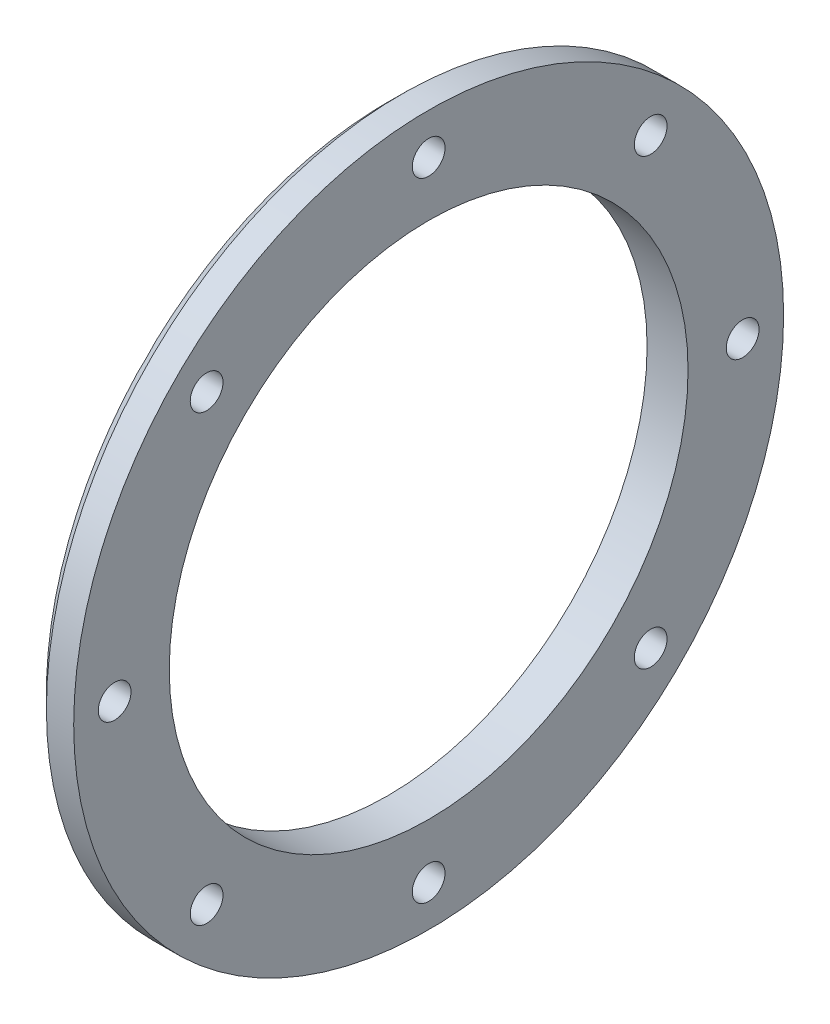
ISO-10303-21;
HEADER;
FILE_DESCRIPTION(('STEP AP214'),'2;1');
FILE_NAME('part.step','',(''),(''),'','','');
FILE_SCHEMA(('AUTOMOTIVE_DESIGN { 1 0 10303 214 1 1 1 1 }'));
ENDSEC;
DATA;
#1=APPLICATION_CONTEXT('core data for automotive mechanical design processes');
#2=APPLICATION_PROTOCOL_DEFINITION('international standard','automotive_design',2000,#1);
#3=PRODUCT_CONTEXT('',#1,'mechanical');
#4=PRODUCT('Part','Part','',(#3));
#5=PRODUCT_RELATED_PRODUCT_CATEGORY('part','',(#4));
#6=PRODUCT_DEFINITION_FORMATION('','',#4);
#7=PRODUCT_DEFINITION_CONTEXT('part definition',#1,'design');
#8=PRODUCT_DEFINITION('design','',#6,#7);
#9=PRODUCT_DEFINITION_SHAPE('','',#8);
#10=(LENGTH_UNIT() NAMED_UNIT(*) SI_UNIT(.MILLI.,.METRE.));
#11=(NAMED_UNIT(*) PLANE_ANGLE_UNIT() SI_UNIT($,.RADIAN.));
#12=(NAMED_UNIT(*) SI_UNIT($,.STERADIAN.) SOLID_ANGLE_UNIT());
#13=UNCERTAINTY_MEASURE_WITH_UNIT(LENGTH_MEASURE(1.E-05),#10,'distance_accuracy_value','');
#14=(GEOMETRIC_REPRESENTATION_CONTEXT(3) GLOBAL_UNCERTAINTY_ASSIGNED_CONTEXT((#13)) GLOBAL_UNIT_ASSIGNED_CONTEXT((#10,
#11,#12)) REPRESENTATION_CONTEXT('',''));
#15=CARTESIAN_POINT('',(0.,0.,0.));
#16=DIRECTION('',(0.,0.,1.));
#17=DIRECTION('',(1.,0.,0.));
#18=AXIS2_PLACEMENT_3D('',#15,#16,#17);
#19=CARTESIAN_POINT('',(0.,0.,0.));
#20=DIRECTION('',(-1.,0.,0.));
#21=DIRECTION('',(0.,0.,1.));
#22=AXIS2_PLACEMENT_3D('',#19,#20,#21);
#23=CYLINDRICAL_SURFACE('',#22,19.);
#24=CARTESIAN_POINT('',(3.,0.,0.));
#25=DIRECTION('',(-1.,0.,0.));
#26=DIRECTION('',(0.,0.,1.));
#27=AXIS2_PLACEMENT_3D('',#24,#25,#26);
#28=CIRCLE('',#27,19.);
#29=CARTESIAN_POINT('',(3.,0.,19.));
#30=VERTEX_POINT('',#29);
#31=EDGE_CURVE('E188',#30,#30,#28,.T.);
#32=ORIENTED_EDGE('',*,*,#31,.F.);
#33=EDGE_LOOP('',(#32));
#34=FACE_BOUND('',#33,.T.);
#35=CARTESIAN_POINT('',(0.,0.,0.));
#36=DIRECTION('',(-1.,0.,0.));
#37=DIRECTION('',(0.,0.,1.));
#38=AXIS2_PLACEMENT_3D('',#35,#36,#37);
#39=CIRCLE('',#38,19.);
#40=CARTESIAN_POINT('',(0.,0.,19.));
#41=VERTEX_POINT('',#40);
#42=EDGE_CURVE('E48',#41,#41,#39,.T.);
#43=ORIENTED_EDGE('',*,*,#42,.T.);
#44=EDGE_LOOP('',(#43));
#45=FACE_BOUND('',#44,.T.);
#46=ADVANCED_FACE('F36',(#34,#45),#23,.F.);
#47=CARTESIAN_POINT('',(0.,19.,0.));
#48=DIRECTION('',(1.,0.,0.));
#49=DIRECTION('',(0.,0.,-1.));
#50=AXIS2_PLACEMENT_3D('',#47,#48,#49);
#51=PLANE('',#50);
#52=ORIENTED_EDGE('',*,*,#42,.F.);
#53=EDGE_LOOP('',(#52));
#54=FACE_BOUND('',#53,.T.);
#55=CARTESIAN_POINT('',(0.,0.,0.));
#56=DIRECTION('',(-1.,0.,0.));
#57=DIRECTION('',(0.,0.,1.));
#58=AXIS2_PLACEMENT_3D('',#55,#56,#57);
#59=CIRCLE('',#58,25.);
#60=CARTESIAN_POINT('',(0.,18.3402976762806,16.9892166136469));
#61=VERTEX_POINT('',#60);
#62=CARTESIAN_POINT('',(0.,24.9817391304348,0.955358581320855));
#63=VERTEX_POINT('',#62);
#64=EDGE_CURVE('E121',#61,#63,#59,.T.);
#65=ORIENTED_EDGE('',*,*,#64,.T.);
#66=CARTESIAN_POINT('',(0.,23.,0.));
#67=DIRECTION('',(-1.,0.,0.));
#68=DIRECTION('',(0.,0.707106781186549,0.707106781186546));
#69=AXIS2_PLACEMENT_3D('',#66,#67,#68);
#70=CIRCLE('',#69,2.2);
#71=CARTESIAN_POINT('',(0.,24.9817391304348,-0.95535858132104));
#72=VERTEX_POINT('',#71);
#73=EDGE_CURVE('E107',#72,#63,#70,.T.);
#74=ORIENTED_EDGE('',*,*,#73,.F.);
#75=CARTESIAN_POINT('',(0.,18.3402976762805,-16.9892166136471));
#76=VERTEX_POINT('',#75);
#77=EDGE_CURVE('E119',#72,#76,#59,.T.);
#78=ORIENTED_EDGE('',*,*,#77,.T.);
#79=CARTESIAN_POINT('',(0.,16.2634559672905,-16.2634559672907));
#80=DIRECTION('',(-1.,0.,0.));
#81=DIRECTION('',(0.,1.,0.));
#82=AXIS2_PLACEMENT_3D('',#79,#80,#81);
#83=CIRCLE('',#82,2.2);
#84=CARTESIAN_POINT('',(0.,16.9892166136469,-18.3402976762807));
#85=VERTEX_POINT('',#84);
#86=EDGE_CURVE('E446',#85,#76,#83,.T.);
#87=ORIENTED_EDGE('',*,*,#86,.F.);
#88=CARTESIAN_POINT('',(0.,0.955358581320752,-24.9817391304348));
#89=VERTEX_POINT('',#88);
#90=EDGE_CURVE('E129',#85,#89,#59,.T.);
#91=ORIENTED_EDGE('',*,*,#90,.T.);
#92=CARTESIAN_POINT('',(0.,-1.64798730217797E-13,-23.));
#93=DIRECTION('',(-1.,0.,0.));
#94=DIRECTION('',(0.,0.707106781186544,-0.707106781186551));
#95=AXIS2_PLACEMENT_3D('',#92,#93,#94);
#96=CIRCLE('',#95,2.2);
#97=CARTESIAN_POINT('',(0.,-0.955358581321128,-24.9817391304348));
#98=VERTEX_POINT('',#97);
#99=EDGE_CURVE('E212',#98,#89,#96,.T.);
#100=ORIENTED_EDGE('',*,*,#99,.F.);
#101=CARTESIAN_POINT('',(0.,-16.989216613647,-18.3402976762805));
#102=VERTEX_POINT('',#101);
#103=EDGE_CURVE('E133',#98,#102,#59,.T.);
#104=ORIENTED_EDGE('',*,*,#103,.T.);
#105=CARTESIAN_POINT('',(0.,-16.2634559672906,-16.2634559672906));
#106=DIRECTION('',(-1.,0.,0.));
#107=DIRECTION('',(0.,0.,-1.));
#108=AXIS2_PLACEMENT_3D('',#105,#106,#107);
#109=CIRCLE('',#108,2.2);
#110=CARTESIAN_POINT('',(0.,-18.3402976762806,-16.9892166136469));
#111=VERTEX_POINT('',#110);
#112=EDGE_CURVE('E211',#111,#102,#109,.T.);
#113=ORIENTED_EDGE('',*,*,#112,.F.);
#114=CARTESIAN_POINT('',(0.,-24.9817391304348,-0.955358581320674));
#115=VERTEX_POINT('',#114);
#116=EDGE_CURVE('E202',#111,#115,#59,.T.);
#117=ORIENTED_EDGE('',*,*,#116,.T.);
#118=CARTESIAN_POINT('',(0.,-23.,2.4459601011273E-13));
#119=DIRECTION('',(-1.,0.,0.));
#120=DIRECTION('',(0.,-0.707106781186554,-0.707106781186541));
#121=AXIS2_PLACEMENT_3D('',#118,#119,#120);
#122=CIRCLE('',#121,2.2);
#123=CARTESIAN_POINT('',(0.,-24.9817391304348,0.955358581321215));
#124=VERTEX_POINT('',#123);
#125=EDGE_CURVE('E269',#124,#115,#122,.T.);
#126=ORIENTED_EDGE('',*,*,#125,.F.);
#127=CARTESIAN_POINT('',(0.,-18.3402976762804,16.9892166136472));
#128=VERTEX_POINT('',#127);
#129=EDGE_CURVE('E199',#124,#128,#59,.T.);
#130=ORIENTED_EDGE('',*,*,#129,.T.);
#131=CARTESIAN_POINT('',(0.,-16.2634559672904,16.2634559672908));
#132=DIRECTION('',(-1.,0.,0.));
#133=DIRECTION('',(0.,-1.,0.));
#134=AXIS2_PLACEMENT_3D('',#131,#132,#133);
#135=CIRCLE('',#134,2.2);
#136=CARTESIAN_POINT('',(0.,-16.9892166136467,18.3402976762808));
#137=VERTEX_POINT('',#136);
#138=EDGE_CURVE('E61',#137,#128,#135,.T.);
#139=ORIENTED_EDGE('',*,*,#138,.F.);
#140=CARTESIAN_POINT('',(0.,-0.955358581320585,24.9817391304348));
#141=VERTEX_POINT('',#140);
#142=EDGE_CURVE('E196',#137,#141,#59,.T.);
#143=ORIENTED_EDGE('',*,*,#142,.T.);
#144=CARTESIAN_POINT('',(0.,3.24393290007663E-13,23.));
#145=DIRECTION('',(-1.,0.,0.));
#146=DIRECTION('',(0.,-0.707106781186539,0.707106781186556));
#147=AXIS2_PLACEMENT_3D('',#144,#145,#146);
#148=CIRCLE('',#147,2.2);
#149=CARTESIAN_POINT('',(0.,0.9553585813213,24.9817391304348));
#150=VERTEX_POINT('',#149);
#151=EDGE_CURVE('E54',#150,#141,#148,.T.);
#152=ORIENTED_EDGE('',*,*,#151,.F.);
#153=CARTESIAN_POINT('',(0.,16.989216613647,18.3402976762805));
#154=VERTEX_POINT('',#153);
#155=EDGE_CURVE('E131',#150,#154,#59,.T.);
#156=ORIENTED_EDGE('',*,*,#155,.T.);
#157=CARTESIAN_POINT('',(0.,16.2634559672906,16.2634559672906));
#158=DIRECTION('',(-1.,0.,0.));
#159=DIRECTION('',(0.,0.,1.));
#160=AXIS2_PLACEMENT_3D('',#157,#158,#159);
#161=CIRCLE('',#160,2.2);
#162=EDGE_CURVE('E112',#61,#154,#161,.T.);
#163=ORIENTED_EDGE('',*,*,#162,.F.);
#164=EDGE_LOOP('',(#65,#74,#78,#87,#91,#100,#104,#113,#117,#126,#130,#139,#143,#152,#156,#163));
#165=FACE_BOUND('',#164,.T.);
#166=ADVANCED_FACE('F117',(#54,#165),#51,.F.);
#167=CARTESIAN_POINT('',(1.,0.,0.));
#168=DIRECTION('',(1.,0.,0.));
#169=DIRECTION('',(0.,0.,-1.));
#170=AXIS2_PLACEMENT_3D('',#167,#168,#169);
#171=CONICAL_SURFACE('',#170,26.,0.785398163397447);
#172=ORIENTED_EDGE('',*,*,#77,.F.);
#173=CARTESIAN_POINT('',(-0.000200000000001783,24.9815026086957,-0.95630928664971));
#174=CARTESIAN_POINT('',(0.0177694926034499,25.0027534869273,-0.871030993264403));
#175=CARTESIAN_POINT('',(0.0335009210973273,25.0213576110843,-0.784586897045019));
#176=CARTESIAN_POINT('',(0.060188759801343,25.0529188812345,-0.609894930946531));
#177=CARTESIAN_POINT('',(0.0711421182031654,25.0658724181328,-0.521645945819592));
#178=CARTESIAN_POINT('',(0.0877207578049995,25.0854784614553,-0.346418157433608));
#179=CARTESIAN_POINT('',(0.0934839042542254,25.0922940085234,-0.259470879919656));
#180=CARTESIAN_POINT('',(0.100036960868125,25.1000437102311,-0.0851610551652993));
#181=CARTESIAN_POINT('',(0.100829115269151,25.1009805189241,0.00220128685692179));
#182=CARTESIAN_POINT('',(0.0977084453883509,25.0972899875922,0.162175447604741));
#183=CARTESIAN_POINT('',(0.0945557607601508,25.0935615953337,0.234825470342914));
#184=CARTESIAN_POINT('',(0.0848451717658192,25.0820777683494,0.37957862536509));
#185=CARTESIAN_POINT('',(0.078287258668774,25.0743223232983,0.451681756246397));
#186=CARTESIAN_POINT('',(0.061688835602273,25.0546928838501,0.596669220070697));
#187=CARTESIAN_POINT('',(0.0515698210412546,25.0427260492402,0.669531857422569));
#188=CARTESIAN_POINT('',(0.0280777857900503,25.0149441640727,0.813963079091831));
#189=CARTESIAN_POINT('',(0.0147059107489856,24.9991304683696,0.885532109501179));
#190=CARTESIAN_POINT('',(-0.000199999999997932,24.9815026086957,0.956309286649521));
#191=B_SPLINE_CURVE_WITH_KNOTS('',3,(#173,#174,#175,#176,#177,#178,#179,#180,#181,#182,#183,
#184,#185,#186,#187,#188,#189,#190),.UNSPECIFIED.,.F.,.F.,(4,2,2,2,2,2,2,2,4),(0.,
0.269090275247995,0.538352170789979,0.800230636032575,1.06199086341173,1.28024339197694,
1.4984964801385,1.72189812645662,1.94522120491509),.UNSPECIFIED.);
#192=EDGE_CURVE('E104',#72,#63,#191,.T.);
#193=ORIENTED_EDGE('',*,*,#192,.T.);
#194=ORIENTED_EDGE('',*,*,#64,.F.);
#195=CARTESIAN_POINT('',(-0.000200000000001783,18.3408026803398,16.9883771173365));
#196=CARTESIAN_POINT('',(0.0177694926034504,18.2955284609028,17.063704616981));
#197=CARTESIAN_POINT('',(0.0335009210973274,18.2475583566219,17.1379849259607));
#198=CARTESIAN_POINT('',(0.0601887598013419,18.146349670921,17.2838279879539));
#199=CARTESIAN_POINT('',(0.0711421182031635,18.093107748886,17.355388977551));
#200=CARTESIAN_POINT('',(0.0877207578049964,17.9830665576516,17.4931573011567));
#201=CARTESIAN_POINT('',(0.0934839042542221,17.9264048676651,17.5594576302419));
#202=CARTESIAN_POINT('',(0.100036960868124,17.8086290751835,17.6881931559828));
#203=CARTESIAN_POINT('',(0.100829115269151,17.7475169944987,17.7506300842265));
#204=CARTESIAN_POINT('',(0.0977084453883504,17.6317885808884,17.861139298375));
#205=CARTESIAN_POINT('',(0.0945557607601478,17.577780885708,17.9098742506576));
#206=CARTESIAN_POINT('',(0.0848451717658153,17.4673046562591,18.0041098962374));
#207=CARTESIAN_POINT('',(0.0782872586687719,17.4108361156814,18.0496105812416));
#208=CARTESIAN_POINT('',(0.0616888356022721,17.2944343870794,18.138252090354));
#209=CARTESIAN_POINT('',(0.0515698210412531,17.2344508922108,18.1813119254187));
#210=CARTESIAN_POINT('',(0.0280777857900483,17.1126778365573,18.26379546228));
#211=CARTESIAN_POINT('',(0.0147059107489837,17.0508889183646,18.3032204375381));
#212=CARTESIAN_POINT('',(-0.000199999999997932,16.9883771173366,18.3408026803397));
#213=B_SPLINE_CURVE_WITH_KNOTS('',3,(#195,#196,#197,#198,#199,#200,#201,#202,#203,#204,#205,
#206,#207,#208,#209,#210,#211,#212),.UNSPECIFIED.,.F.,.F.,(4,2,2,2,2,2,2,2,4),(0.,
0.269090275247992,0.538352170789979,0.800230636032571,1.06199086341173,1.28024339197694,
1.49849648013849,1.72189812645662,1.94522120491508),.UNSPECIFIED.);
#214=EDGE_CURVE('E11',#61,#154,#213,.T.);
#215=ORIENTED_EDGE('',*,*,#214,.T.);
#216=ORIENTED_EDGE('',*,*,#155,.F.);
#217=CARTESIAN_POINT('',(-0.000200000000001783,0.95630928664997,24.9815026086956));
#218=CARTESIAN_POINT('',(0.0177694926034508,0.871030993264663,25.0027534869273));
#219=CARTESIAN_POINT('',(0.0335009210973279,0.78458689704528,25.0213576110843));
#220=CARTESIAN_POINT('',(0.0601887598013425,0.609894930946793,25.0529188812345));
#221=CARTESIAN_POINT('',(0.071142118203164,0.521645945819853,25.0658724181327));
#222=CARTESIAN_POINT('',(0.0877207578049966,0.346418157433869,25.0854784614553));
#223=CARTESIAN_POINT('',(0.0934839042542221,0.259470879919917,25.0922940085234));
#224=CARTESIAN_POINT('',(0.100036960868124,0.085161055165561,25.1000437102311));
#225=CARTESIAN_POINT('',(0.100829115269151,-0.00220128685666002,25.1009805189241));
#226=CARTESIAN_POINT('',(0.0977084453883509,-0.162175447604479,25.0972899875922));
#227=CARTESIAN_POINT('',(0.0945557607601496,-0.234825470342652,25.0935615953337));
#228=CARTESIAN_POINT('',(0.0848451717658166,-0.379578625364828,25.0820777683494));
#229=CARTESIAN_POINT('',(0.0782872586687715,-0.451681756246134,25.0743223232983));
#230=CARTESIAN_POINT('',(0.0616888356022702,-0.596669220070435,25.0546928838501));
#231=CARTESIAN_POINT('',(0.0515698210412515,-0.669531857422307,25.0427260492402));
#232=CARTESIAN_POINT('',(0.0280777857900475,-0.813963079091569,25.0149441640727));
#233=CARTESIAN_POINT('',(0.0147059107489836,-0.885532109500917,24.9991304683696));
#234=CARTESIAN_POINT('',(-0.000199999999997932,-0.956309286649259,24.9815026086957));
#235=B_SPLINE_CURVE_WITH_KNOTS('',3,(#217,#218,#219,#220,#221,#222,#223,#224,#225,#226,#227,
#228,#229,#230,#231,#232,#233,#234),.UNSPECIFIED.,.F.,.F.,(4,2,2,2,2,2,2,2,4),(0.,
0.269090275247993,0.538352170789978,0.800230636032573,1.06199086341173,1.28024339197694,
1.49849648013849,1.72189812645662,1.94522120491508),.UNSPECIFIED.);
#236=EDGE_CURVE('E171',#150,#141,#235,.T.);
#237=ORIENTED_EDGE('',*,*,#236,.T.);
#238=ORIENTED_EDGE('',*,*,#142,.F.);
#239=CARTESIAN_POINT('',(-0.000200000000001783,-16.9883771173363,18.34080268034));
#240=CARTESIAN_POINT('',(0.0177694926034506,-17.0637046169808,18.295528460903));
#241=CARTESIAN_POINT('',(0.0335009210973278,-17.1379849259605,18.2475583566221));
#242=CARTESIAN_POINT('',(0.0601887598013426,-17.2838279879537,18.1463496709212));
#243=CARTESIAN_POINT('',(0.0711421182031641,-17.3553889775509,18.0931077488862));
#244=CARTESIAN_POINT('',(0.0877207578049964,-17.4931573011565,17.9830665576517));
#245=CARTESIAN_POINT('',(0.0934839042542215,-17.5594576302417,17.9264048676653));
#246=CARTESIAN_POINT('',(0.100036960868123,-17.6881931559826,17.8086290751837));
#247=CARTESIAN_POINT('',(0.100829115269151,-17.7506300842263,17.7475169944989));
#248=CARTESIAN_POINT('',(0.0977084453883506,-17.8611392983748,17.6317885808885));
#249=CARTESIAN_POINT('',(0.0945557607601483,-17.9098742506574,17.5777808857081));
#250=CARTESIAN_POINT('',(0.0848451717658157,-18.0041098962372,17.4673046562593));
#251=CARTESIAN_POINT('',(0.0782872586687719,-18.0496105812414,17.4108361156816));
#252=CARTESIAN_POINT('',(0.0616888356022722,-18.1382520903538,17.2944343870796));
#253=CARTESIAN_POINT('',(0.0515698210412536,-18.1813119254185,17.234450892211));
#254=CARTESIAN_POINT('',(0.0280777857900491,-18.2637954622798,17.1126778365575));
#255=CARTESIAN_POINT('',(0.0147059107489845,-18.3032204375379,17.0508889183648));
#256=CARTESIAN_POINT('',(-0.000199999999997932,-18.3408026803395,16.9883771173367));
#257=B_SPLINE_CURVE_WITH_KNOTS('',3,(#239,#240,#241,#242,#243,#244,#245,#246,#247,#248,#249,
#250,#251,#252,#253,#254,#255,#256),.UNSPECIFIED.,.F.,.F.,(4,2,2,2,2,2,2,2,4),(0.,
0.269090275247993,0.53835217078998,0.800230636032578,1.06199086341173,1.28024339197694,
1.49849648013849,1.72189812645662,1.94522120491508),.UNSPECIFIED.);
#258=EDGE_CURVE('E294',#137,#128,#257,.T.);
#259=ORIENTED_EDGE('',*,*,#258,.T.);
#260=ORIENTED_EDGE('',*,*,#129,.F.);
#261=CARTESIAN_POINT('',(-0.000200000000001783,-24.9815026086956,0.956309286649883));
#262=CARTESIAN_POINT('',(0.0177694926034509,-25.0027534869273,0.871030993264576));
#263=CARTESIAN_POINT('',(0.0335009210973277,-25.0213576110843,0.784586897045193));
#264=CARTESIAN_POINT('',(0.0601887598013417,-25.0529188812345,0.609894930946706));
#265=CARTESIAN_POINT('',(0.0711421182031629,-25.0658724181328,0.521645945819766));
#266=CARTESIAN_POINT('',(0.0877207578049959,-25.0854784614553,0.346418157433782));
#267=CARTESIAN_POINT('',(0.093483904254222,-25.0922940085234,0.25947087991983));
#268=CARTESIAN_POINT('',(0.100036960868124,-25.1000437102311,0.0851610551654741));
#269=CARTESIAN_POINT('',(0.100829115269151,-25.1009805189241,-0.00220128685674679));
#270=CARTESIAN_POINT('',(0.0977084453883506,-25.0972899875922,-0.162175447604566));
#271=CARTESIAN_POINT('',(0.0945557607601488,-25.0935615953337,-0.234825470342739));
#272=CARTESIAN_POINT('',(0.0848451717658164,-25.0820777683494,-0.379578625364915));
#273=CARTESIAN_POINT('',(0.0782872586687722,-25.0743223232983,-0.451681756246221));
#274=CARTESIAN_POINT('',(0.0616888356022713,-25.0546928838501,-0.596669220070522));
#275=CARTESIAN_POINT('',(0.0515698210412521,-25.0427260492402,-0.669531857422394));
#276=CARTESIAN_POINT('',(0.0280777857900472,-25.0149441640727,-0.813963079091656));
#277=CARTESIAN_POINT('',(0.014705910748983,-24.9991304683696,-0.885532109501004));
#278=CARTESIAN_POINT('',(-0.000199999999997932,-24.9815026086957,-0.956309286649346));
#279=B_SPLINE_CURVE_WITH_KNOTS('',3,(#261,#262,#263,#264,#265,#266,#267,#268,#269,#270,#271,
#272,#273,#274,#275,#276,#277,#278),.UNSPECIFIED.,.F.,.F.,(4,2,2,2,2,2,2,2,4),(0.,
0.269090275247994,0.538352170789979,0.800230636032574,1.06199086341173,1.28024339197694,
1.49849648013849,1.72189812645662,1.94522120491509),.UNSPECIFIED.);
#280=EDGE_CURVE('E263',#124,#115,#279,.T.);
#281=ORIENTED_EDGE('',*,*,#280,.T.);
#282=ORIENTED_EDGE('',*,*,#116,.F.);
#283=CARTESIAN_POINT('',(-0.000200000000001783,-18.3408026803398,-16.9883771173365));
#284=CARTESIAN_POINT('',(0.0177694926034504,-18.2955284609028,-17.063704616981));
#285=CARTESIAN_POINT('',(0.0335009210973274,-18.2475583566219,-17.1379849259607));
#286=CARTESIAN_POINT('',(0.0601887598013419,-18.146349670921,-17.2838279879539));
#287=CARTESIAN_POINT('',(0.0711421182031635,-18.093107748886,-17.355388977551));
#288=CARTESIAN_POINT('',(0.0877207578049964,-17.9830665576516,-17.4931573011567));
#289=CARTESIAN_POINT('',(0.0934839042542221,-17.9264048676651,-17.5594576302419));
#290=CARTESIAN_POINT('',(0.100036960868124,-17.8086290751835,-17.6881931559828));
#291=CARTESIAN_POINT('',(0.100829115269151,-17.7475169944987,-17.7506300842265));
#292=CARTESIAN_POINT('',(0.0977084453883504,-17.6317885808884,-17.861139298375));
#293=CARTESIAN_POINT('',(0.0945557607601478,-17.577780885708,-17.9098742506576));
#294=CARTESIAN_POINT('',(0.0848451717658153,-17.4673046562591,-18.0041098962374));
#295=CARTESIAN_POINT('',(0.0782872586687719,-17.4108361156814,-18.0496105812416));
#296=CARTESIAN_POINT('',(0.0616888356022721,-17.2944343870794,-18.138252090354));
#297=CARTESIAN_POINT('',(0.0515698210412531,-17.2344508922108,-18.1813119254187));
#298=CARTESIAN_POINT('',(0.0280777857900483,-17.1126778365573,-18.26379546228));
#299=CARTESIAN_POINT('',(0.0147059107489837,-17.0508889183646,-18.3032204375381));
#300=CARTESIAN_POINT('',(-0.000199999999997932,-16.9883771173366,-18.3408026803397));
#301=B_SPLINE_CURVE_WITH_KNOTS('',3,(#283,#284,#285,#286,#287,#288,#289,#290,#291,#292,#293,
#294,#295,#296,#297,#298,#299,#300),.UNSPECIFIED.,.F.,.F.,(4,2,2,2,2,2,2,2,4),(0.,
0.269090275247992,0.538352170789979,0.800230636032571,1.06199086341173,1.28024339197694,
1.49849648013849,1.72189812645662,1.94522120491508),.UNSPECIFIED.);
#302=EDGE_CURVE('E216',#111,#102,#301,.T.);
#303=ORIENTED_EDGE('',*,*,#302,.T.);
#304=ORIENTED_EDGE('',*,*,#103,.F.);
#305=CARTESIAN_POINT('',(-0.000200000000001783,-0.956309286649798,-24.9815026086957));
#306=CARTESIAN_POINT('',(0.0177694926034497,-0.871030993264491,-25.0027534869273));
#307=CARTESIAN_POINT('',(0.0335009210973265,-0.784586897045107,-25.0213576110843));
#308=CARTESIAN_POINT('',(0.0601887598013413,-0.60989493094662,-25.0529188812345));
#309=CARTESIAN_POINT('',(0.0711421182031633,-0.52164594581968,-25.0658724181328));
#310=CARTESIAN_POINT('',(0.0877207578049968,-0.346418157433696,-25.0854784614553));
#311=CARTESIAN_POINT('',(0.0934839042542227,-0.259470879919744,-25.0922940085234));
#312=CARTESIAN_POINT('',(0.100036960868124,-0.0851610551653875,-25.1000437102311));
#313=CARTESIAN_POINT('',(0.100829115269151,0.00220128685683348,-25.1009805189241));
#314=CARTESIAN_POINT('',(0.0977084453883505,0.162175447604652,-25.0972899875922));
#315=CARTESIAN_POINT('',(0.0945557607601484,0.234825470342826,-25.0935615953337));
#316=CARTESIAN_POINT('',(0.0848451717658155,0.379578625365002,-25.0820777683494));
#317=CARTESIAN_POINT('',(0.078287258668771,0.451681756246308,-25.0743223232983));
#318=CARTESIAN_POINT('',(0.0616888356022707,0.596669220070608,-25.0546928838501));
#319=CARTESIAN_POINT('',(0.0515698210412523,0.66953185742248,-25.0427260492402));
#320=CARTESIAN_POINT('',(0.0280777857900484,0.813963079091742,-25.0149441640727));
#321=CARTESIAN_POINT('',(0.0147059107489843,0.88553210950109,-24.9991304683696));
#322=CARTESIAN_POINT('',(-0.000199999999997932,0.956309286649432,-24.9815026086957));
#323=B_SPLINE_CURVE_WITH_KNOTS('',3,(#305,#306,#307,#308,#309,#310,#311,#312,#313,#314,#315,
#316,#317,#318,#319,#320,#321,#322),.UNSPECIFIED.,.F.,.F.,(4,2,2,2,2,2,2,2,4),(0.,
0.269090275247994,0.538352170789978,0.800230636032574,1.06199086341173,1.28024339197694,
1.49849648013849,1.72189812645662,1.94522120491509),.UNSPECIFIED.);
#324=EDGE_CURVE('E215',#98,#89,#323,.T.);
#325=ORIENTED_EDGE('',*,*,#324,.T.);
#326=ORIENTED_EDGE('',*,*,#90,.F.);
#327=CARTESIAN_POINT('',(-0.000200000000001783,16.9883771173364,-18.3408026803398));
#328=CARTESIAN_POINT('',(0.0177694926034491,17.063704616981,-18.2955284609028));
#329=CARTESIAN_POINT('',(0.0335009210973265,17.1379849259607,-18.247558356622));
#330=CARTESIAN_POINT('',(0.0601887598013424,17.2838279879538,-18.1463496709211));
#331=CARTESIAN_POINT('',(0.071142118203165,17.355388977551,-18.0931077488861));
#332=CARTESIAN_POINT('',(0.0877207578049977,17.4931573011566,-17.9830665576516));
#333=CARTESIAN_POINT('',(0.0934839042542222,17.5594576302418,-17.9264048676651));
#334=CARTESIAN_POINT('',(0.100036960868123,17.6881931559827,-17.8086290751836));
#335=CARTESIAN_POINT('',(0.100829115269151,17.7506300842265,-17.7475169944988));
#336=CARTESIAN_POINT('',(0.0977084453883511,17.8611392983749,-17.6317885808884));
#337=CARTESIAN_POINT('',(0.0945557607601499,17.9098742506576,-17.577780885708));
#338=CARTESIAN_POINT('',(0.0848451717658172,18.0041098962373,-17.4673046562591));
#339=CARTESIAN_POINT('',(0.0782872586687721,18.0496105812415,-17.4108361156814));
#340=CARTESIAN_POINT('',(0.061688835602271,18.138252090354,-17.2944343870795));
#341=CARTESIAN_POINT('',(0.0515698210412523,18.1813119254187,-17.2344508922109));
#342=CARTESIAN_POINT('',(0.0280777857900481,18.2637954622799,-17.1126778365574));
#343=CARTESIAN_POINT('',(0.0147059107489839,18.303220437538,-17.0508889183647));
#344=CARTESIAN_POINT('',(-0.000199999999997932,18.3408026803396,-16.9883771173366));
#345=B_SPLINE_CURVE_WITH_KNOTS('',3,(#327,#328,#329,#330,#331,#332,#333,#334,#335,#336,#337,
#338,#339,#340,#341,#342,#343,#344),.UNSPECIFIED.,.F.,.F.,(4,2,2,2,2,2,2,2,4),(0.,
0.269090275247992,0.538352170789974,0.800230636032569,1.06199086341173,1.28024339197694,
1.49849648013849,1.72189812645662,1.94522120491509),.UNSPECIFIED.);
#346=EDGE_CURVE('E128',#85,#76,#345,.T.);
#347=ORIENTED_EDGE('',*,*,#346,.T.);
#348=EDGE_LOOP('',(#172,#193,#194,#215,#216,#237,#238,#259,#260,#281,#282,#303,#304,#325,#326,#347));
#349=FACE_BOUND('',#348,.T.);
#350=CARTESIAN_POINT('',(1.,0.,0.));
#351=DIRECTION('',(-1.,0.,0.));
#352=DIRECTION('',(0.,0.,1.));
#353=AXIS2_PLACEMENT_3D('',#350,#351,#352);
#354=CIRCLE('',#353,26.);
#355=CARTESIAN_POINT('',(1.,0.,26.));
#356=VERTEX_POINT('',#355);
#357=EDGE_CURVE('E135',#356,#356,#354,.T.);
#358=ORIENTED_EDGE('',*,*,#357,.T.);
#359=EDGE_LOOP('',(#358));
#360=FACE_BOUND('',#359,.T.);
#361=ADVANCED_FACE('F125',(#349,#360),#171,.T.);
#362=CARTESIAN_POINT('',(0.,0.,0.));
#363=DIRECTION('',(-1.,0.,0.));
#364=DIRECTION('',(0.,0.,1.));
#365=AXIS2_PLACEMENT_3D('',#362,#363,#364);
#366=CYLINDRICAL_SURFACE('',#365,26.);
#367=ORIENTED_EDGE('',*,*,#357,.F.);
#368=EDGE_LOOP('',(#367));
#369=FACE_BOUND('',#368,.T.);
#370=CARTESIAN_POINT('',(3.,0.,0.));
#371=DIRECTION('',(-1.,0.,0.));
#372=DIRECTION('',(0.,0.,1.));
#373=AXIS2_PLACEMENT_3D('',#370,#371,#372);
#374=CIRCLE('',#373,26.);
#375=CARTESIAN_POINT('',(3.,0.,26.));
#376=VERTEX_POINT('',#375);
#377=EDGE_CURVE('E190',#376,#376,#374,.T.);
#378=ORIENTED_EDGE('',*,*,#377,.T.);
#379=EDGE_LOOP('',(#378));
#380=FACE_BOUND('',#379,.T.);
#381=ADVANCED_FACE('F146',(#369,#380),#366,.T.);
#382=CARTESIAN_POINT('',(3.,26.,0.));
#383=DIRECTION('',(-1.,0.,0.));
#384=DIRECTION('',(0.,0.,1.));
#385=AXIS2_PLACEMENT_3D('',#382,#383,#384);
#386=PLANE('',#385);
#387=CARTESIAN_POINT('',(3.,23.,0.));
#388=DIRECTION('',(-1.,0.,0.));
#389=DIRECTION('',(0.,0.707106781186549,0.707106781186546));
#390=AXIS2_PLACEMENT_3D('',#387,#388,#389);
#391=CIRCLE('',#390,1.2);
#392=CARTESIAN_POINT('',(3.,23.8485281374239,0.848528137423772));
#393=VERTEX_POINT('',#392);
#394=EDGE_CURVE('E122',#393,#393,#391,.T.);
#395=ORIENTED_EDGE('',*,*,#394,.T.);
#396=EDGE_LOOP('',(#395));
#397=FACE_BOUND('',#396,.T.);
#398=CARTESIAN_POINT('',(3.,16.2634559672905,-16.2634559672907));
#399=DIRECTION('',(-1.,0.,0.));
#400=DIRECTION('',(0.,1.,0.));
#401=AXIS2_PLACEMENT_3D('',#398,#399,#400);
#402=CIRCLE('',#401,1.2);
#403=CARTESIAN_POINT('',(3.,17.4634559672905,-16.2634559672907));
#404=VERTEX_POINT('',#403);
#405=EDGE_CURVE('E258',#404,#404,#402,.T.);
#406=ORIENTED_EDGE('',*,*,#405,.T.);
#407=EDGE_LOOP('',(#406));
#408=FACE_BOUND('',#407,.T.);
#409=CARTESIAN_POINT('',(3.,-1.64798730217797E-13,-23.));
#410=DIRECTION('',(-1.,0.,0.));
#411=DIRECTION('',(0.,0.707106781186544,-0.707106781186551));
#412=AXIS2_PLACEMENT_3D('',#409,#410,#411);
#413=CIRCLE('',#412,1.2);
#414=CARTESIAN_POINT('',(3.,0.848528137423687,-23.8485281374239));
#415=VERTEX_POINT('',#414);
#416=EDGE_CURVE('E219',#415,#415,#413,.T.);
#417=ORIENTED_EDGE('',*,*,#416,.T.);
#418=EDGE_LOOP('',(#417));
#419=FACE_BOUND('',#418,.T.);
#420=CARTESIAN_POINT('',(3.,-16.2634559672906,-16.2634559672906));
#421=DIRECTION('',(-1.,0.,0.));
#422=DIRECTION('',(0.,0.,-1.));
#423=AXIS2_PLACEMENT_3D('',#420,#421,#422);
#424=CIRCLE('',#423,1.2);
#425=CARTESIAN_POINT('',(3.,-16.2634559672906,-17.4634559672906));
#426=VERTEX_POINT('',#425);
#427=EDGE_CURVE('E261',#426,#426,#424,.T.);
#428=ORIENTED_EDGE('',*,*,#427,.T.);
#429=EDGE_LOOP('',(#428));
#430=FACE_BOUND('',#429,.T.);
#431=CARTESIAN_POINT('',(3.,-23.,2.4459601011273E-13));
#432=DIRECTION('',(-1.,0.,0.));
#433=DIRECTION('',(0.,-0.707106781186554,-0.707106781186541));
#434=AXIS2_PLACEMENT_3D('',#431,#432,#433);
#435=CIRCLE('',#434,1.2);
#436=CARTESIAN_POINT('',(3.,-23.8485281374239,-0.848528137423605));
#437=VERTEX_POINT('',#436);
#438=EDGE_CURVE('E233',#437,#437,#435,.T.);
#439=ORIENTED_EDGE('',*,*,#438,.T.);
#440=EDGE_LOOP('',(#439));
#441=FACE_BOUND('',#440,.T.);
#442=CARTESIAN_POINT('',(3.,-16.2634559672904,16.2634559672908));
#443=DIRECTION('',(-1.,0.,0.));
#444=DIRECTION('',(0.,-1.,0.));
#445=AXIS2_PLACEMENT_3D('',#442,#443,#444);
#446=CIRCLE('',#445,1.2);
#447=CARTESIAN_POINT('',(3.,-17.4634559672904,16.2634559672908));
#448=VERTEX_POINT('',#447);
#449=EDGE_CURVE('E177',#448,#448,#446,.T.);
#450=ORIENTED_EDGE('',*,*,#449,.T.);
#451=EDGE_LOOP('',(#450));
#452=FACE_BOUND('',#451,.T.);
#453=CARTESIAN_POINT('',(3.,3.24393290007663E-13,23.));
#454=DIRECTION('',(-1.,0.,0.));
#455=DIRECTION('',(0.,-0.707106781186539,0.707106781186556));
#456=AXIS2_PLACEMENT_3D('',#453,#454,#455);
#457=CIRCLE('',#456,1.2);
#458=CARTESIAN_POINT('',(3.,-0.848528137423522,23.8485281374239));
#459=VERTEX_POINT('',#458);
#460=EDGE_CURVE('E306',#459,#459,#457,.T.);
#461=ORIENTED_EDGE('',*,*,#460,.T.);
#462=EDGE_LOOP('',(#461));
#463=FACE_BOUND('',#462,.T.);
#464=CARTESIAN_POINT('',(3.,16.2634559672906,16.2634559672906));
#465=DIRECTION('',(-1.,0.,0.));
#466=DIRECTION('',(0.,0.,1.));
#467=AXIS2_PLACEMENT_3D('',#464,#465,#466);
#468=CIRCLE('',#467,1.2);
#469=CARTESIAN_POINT('',(3.,16.2634559672906,17.4634559672906));
#470=VERTEX_POINT('',#469);
#471=EDGE_CURVE('E185',#470,#470,#468,.T.);
#472=ORIENTED_EDGE('',*,*,#471,.T.);
#473=EDGE_LOOP('',(#472));
#474=FACE_BOUND('',#473,.T.);
#475=ORIENTED_EDGE('',*,*,#377,.F.);
#476=EDGE_LOOP('',(#475));
#477=FACE_BOUND('',#476,.T.);
#478=ORIENTED_EDGE('',*,*,#31,.T.);
#479=EDGE_LOOP('',(#478));
#480=FACE_BOUND('',#479,.T.);
#481=ADVANCED_FACE('F152',(#397,#408,#419,#430,#441,#452,#463,#474,#477,#480),#386,.F.);
#482=CARTESIAN_POINT('',(0.,16.2634559672906,16.2634559672906));
#483=DIRECTION('',(-1.,0.,0.));
#484=DIRECTION('',(0.,0.,1.));
#485=AXIS2_PLACEMENT_3D('',#482,#483,#484);
#486=CONICAL_SURFACE('',#485,2.2,0.785398163397449);
#487=CARTESIAN_POINT('',(1.,16.2634559672906,16.2634559672906));
#488=DIRECTION('',(-1.,0.,0.));
#489=DIRECTION('',(0.,0.,1.));
#490=AXIS2_PLACEMENT_3D('',#487,#488,#489);
#491=CIRCLE('',#490,1.2);
#492=CARTESIAN_POINT('',(1.,16.2634559672906,17.4634559672906));
#493=VERTEX_POINT('',#492);
#494=EDGE_CURVE('E182',#493,#493,#491,.T.);
#495=ORIENTED_EDGE('',*,*,#494,.F.);
#496=EDGE_LOOP('',(#495));
#497=FACE_BOUND('',#496,.T.);
#498=ORIENTED_EDGE('',*,*,#162,.T.);
#499=ORIENTED_EDGE('',*,*,#214,.F.);
#500=EDGE_LOOP('',(#498,#499));
#501=FACE_BOUND('',#500,.T.);
#502=ADVANCED_FACE('F156',(#497,#501),#486,.F.);
#503=CARTESIAN_POINT('',(0.,16.2634559672906,16.2634559672906));
#504=DIRECTION('',(-1.,0.,0.));
#505=DIRECTION('',(0.,0.,1.));
#506=AXIS2_PLACEMENT_3D('',#503,#504,#505);
#507=CYLINDRICAL_SURFACE('',#506,1.2);
#508=ORIENTED_EDGE('',*,*,#471,.F.);
#509=EDGE_LOOP('',(#508));
#510=FACE_BOUND('',#509,.T.);
#511=ORIENTED_EDGE('',*,*,#494,.T.);
#512=EDGE_LOOP('',(#511));
#513=FACE_BOUND('',#512,.T.);
#514=ADVANCED_FACE('F158',(#510,#513),#507,.F.);
#515=CARTESIAN_POINT('',(0.,3.24393290007663E-13,23.));
#516=DIRECTION('',(-1.,0.,0.));
#517=DIRECTION('',(0.,-0.707106781186539,0.707106781186556));
#518=AXIS2_PLACEMENT_3D('',#515,#516,#517);
#519=CONICAL_SURFACE('',#518,2.2,0.785398163397449);
#520=CARTESIAN_POINT('',(1.,3.24393290007663E-13,23.));
#521=DIRECTION('',(-1.,0.,0.));
#522=DIRECTION('',(0.,-0.707106781186539,0.707106781186556));
#523=AXIS2_PLACEMENT_3D('',#520,#521,#522);
#524=CIRCLE('',#523,1.2);
#525=CARTESIAN_POINT('',(1.,-0.848528137423522,23.8485281374239));
#526=VERTEX_POINT('',#525);
#527=EDGE_CURVE('E178',#526,#526,#524,.T.);
#528=ORIENTED_EDGE('',*,*,#527,.F.);
#529=EDGE_LOOP('',(#528));
#530=FACE_BOUND('',#529,.T.);
#531=ORIENTED_EDGE('',*,*,#151,.T.);
#532=ORIENTED_EDGE('',*,*,#236,.F.);
#533=EDGE_LOOP('',(#531,#532));
#534=FACE_BOUND('',#533,.T.);
#535=ADVANCED_FACE('F160',(#530,#534),#519,.F.);
#536=CARTESIAN_POINT('',(0.,3.24393290007663E-13,23.));
#537=DIRECTION('',(-1.,0.,0.));
#538=DIRECTION('',(0.,-0.707106781186539,0.707106781186556));
#539=AXIS2_PLACEMENT_3D('',#536,#537,#538);
#540=CYLINDRICAL_SURFACE('',#539,1.2);
#541=ORIENTED_EDGE('',*,*,#460,.F.);
#542=EDGE_LOOP('',(#541));
#543=FACE_BOUND('',#542,.T.);
#544=ORIENTED_EDGE('',*,*,#527,.T.);
#545=EDGE_LOOP('',(#544));
#546=FACE_BOUND('',#545,.T.);
#547=ADVANCED_FACE('F311',(#543,#546),#540,.F.);
#548=CARTESIAN_POINT('',(0.,-16.2634559672904,16.2634559672908));
#549=DIRECTION('',(-1.,0.,0.));
#550=DIRECTION('',(0.,-1.,0.));
#551=AXIS2_PLACEMENT_3D('',#548,#549,#550);
#552=CONICAL_SURFACE('',#551,2.2,0.785398163397449);
#553=CARTESIAN_POINT('',(1.,-16.2634559672904,16.2634559672908));
#554=DIRECTION('',(-1.,0.,0.));
#555=DIRECTION('',(0.,-1.,0.));
#556=AXIS2_PLACEMENT_3D('',#553,#554,#555);
#557=CIRCLE('',#556,1.2);
#558=CARTESIAN_POINT('',(1.,-17.4634559672904,16.2634559672908));
#559=VERTEX_POINT('',#558);
#560=EDGE_CURVE('E296',#559,#559,#557,.T.);
#561=ORIENTED_EDGE('',*,*,#560,.F.);
#562=EDGE_LOOP('',(#561));
#563=FACE_BOUND('',#562,.T.);
#564=ORIENTED_EDGE('',*,*,#138,.T.);
#565=ORIENTED_EDGE('',*,*,#258,.F.);
#566=EDGE_LOOP('',(#564,#565));
#567=FACE_BOUND('',#566,.T.);
#568=ADVANCED_FACE('F308',(#563,#567),#552,.F.);
#569=CARTESIAN_POINT('',(0.,-16.2634559672904,16.2634559672908));
#570=DIRECTION('',(-1.,0.,0.));
#571=DIRECTION('',(0.,-1.,0.));
#572=AXIS2_PLACEMENT_3D('',#569,#570,#571);
#573=CYLINDRICAL_SURFACE('',#572,1.2);
#574=ORIENTED_EDGE('',*,*,#449,.F.);
#575=EDGE_LOOP('',(#574));
#576=FACE_BOUND('',#575,.T.);
#577=ORIENTED_EDGE('',*,*,#560,.T.);
#578=EDGE_LOOP('',(#577));
#579=FACE_BOUND('',#578,.T.);
#580=ADVANCED_FACE('F283',(#576,#579),#573,.F.);
#581=CARTESIAN_POINT('',(0.,-23.,2.4459601011273E-13));
#582=DIRECTION('',(-1.,0.,0.));
#583=DIRECTION('',(0.,-0.707106781186554,-0.707106781186541));
#584=AXIS2_PLACEMENT_3D('',#581,#582,#583);
#585=CONICAL_SURFACE('',#584,2.2,0.785398163397449);
#586=CARTESIAN_POINT('',(1.,-23.,2.4459601011273E-13));
#587=DIRECTION('',(-1.,0.,0.));
#588=DIRECTION('',(0.,-0.707106781186554,-0.707106781186541));
#589=AXIS2_PLACEMENT_3D('',#586,#587,#588);
#590=CIRCLE('',#589,1.2);
#591=CARTESIAN_POINT('',(1.,-23.8485281374239,-0.848528137423605));
#592=VERTEX_POINT('',#591);
#593=EDGE_CURVE('E266',#592,#592,#590,.T.);
#594=ORIENTED_EDGE('',*,*,#593,.F.);
#595=EDGE_LOOP('',(#594));
#596=FACE_BOUND('',#595,.T.);
#597=ORIENTED_EDGE('',*,*,#125,.T.);
#598=ORIENTED_EDGE('',*,*,#280,.F.);
#599=EDGE_LOOP('',(#597,#598));
#600=FACE_BOUND('',#599,.T.);
#601=ADVANCED_FACE('F280',(#596,#600),#585,.F.);
#602=CARTESIAN_POINT('',(0.,-23.,2.4459601011273E-13));
#603=DIRECTION('',(-1.,0.,0.));
#604=DIRECTION('',(0.,-0.707106781186554,-0.707106781186541));
#605=AXIS2_PLACEMENT_3D('',#602,#603,#604);
#606=CYLINDRICAL_SURFACE('',#605,1.2);
#607=ORIENTED_EDGE('',*,*,#438,.F.);
#608=EDGE_LOOP('',(#607));
#609=FACE_BOUND('',#608,.T.);
#610=ORIENTED_EDGE('',*,*,#593,.T.);
#611=EDGE_LOOP('',(#610));
#612=FACE_BOUND('',#611,.T.);
#613=ADVANCED_FACE('F242',(#609,#612),#606,.F.);
#614=CARTESIAN_POINT('',(0.,-16.2634559672906,-16.2634559672906));
#615=DIRECTION('',(-1.,0.,0.));
#616=DIRECTION('',(0.,0.,-1.));
#617=AXIS2_PLACEMENT_3D('',#614,#615,#616);
#618=CONICAL_SURFACE('',#617,2.2,0.785398163397449);
#619=CARTESIAN_POINT('',(1.,-16.2634559672906,-16.2634559672906));
#620=DIRECTION('',(-1.,0.,0.));
#621=DIRECTION('',(0.,0.,-1.));
#622=AXIS2_PLACEMENT_3D('',#619,#620,#621);
#623=CIRCLE('',#622,1.2);
#624=CARTESIAN_POINT('',(1.,-16.2634559672906,-17.4634559672906));
#625=VERTEX_POINT('',#624);
#626=EDGE_CURVE('E220',#625,#625,#623,.T.);
#627=ORIENTED_EDGE('',*,*,#626,.F.);
#628=EDGE_LOOP('',(#627));
#629=FACE_BOUND('',#628,.T.);
#630=ORIENTED_EDGE('',*,*,#112,.T.);
#631=ORIENTED_EDGE('',*,*,#302,.F.);
#632=EDGE_LOOP('',(#630,#631));
#633=FACE_BOUND('',#632,.T.);
#634=ADVANCED_FACE('F237',(#629,#633),#618,.F.);
#635=CARTESIAN_POINT('',(0.,-16.2634559672906,-16.2634559672906));
#636=DIRECTION('',(-1.,0.,0.));
#637=DIRECTION('',(0.,0.,-1.));
#638=AXIS2_PLACEMENT_3D('',#635,#636,#637);
#639=CYLINDRICAL_SURFACE('',#638,1.2);
#640=ORIENTED_EDGE('',*,*,#427,.F.);
#641=EDGE_LOOP('',(#640));
#642=FACE_BOUND('',#641,.T.);
#643=ORIENTED_EDGE('',*,*,#626,.T.);
#644=EDGE_LOOP('',(#643));
#645=FACE_BOUND('',#644,.T.);
#646=ADVANCED_FACE('F241',(#642,#645),#639,.F.);
#647=CARTESIAN_POINT('',(0.,-1.64798730217797E-13,-23.));
#648=DIRECTION('',(-1.,0.,0.));
#649=DIRECTION('',(0.,0.707106781186544,-0.707106781186551));
#650=AXIS2_PLACEMENT_3D('',#647,#648,#649);
#651=CONICAL_SURFACE('',#650,2.2,0.785398163397449);
#652=CARTESIAN_POINT('',(1.,-1.64798730217797E-13,-23.));
#653=DIRECTION('',(-1.,0.,0.));
#654=DIRECTION('',(0.,0.707106781186544,-0.707106781186551));
#655=AXIS2_PLACEMENT_3D('',#652,#653,#654);
#656=CIRCLE('',#655,1.2);
#657=CARTESIAN_POINT('',(1.,0.848528137423687,-23.8485281374239));
#658=VERTEX_POINT('',#657);
#659=EDGE_CURVE('E259',#658,#658,#656,.T.);
#660=ORIENTED_EDGE('',*,*,#659,.F.);
#661=EDGE_LOOP('',(#660));
#662=FACE_BOUND('',#661,.T.);
#663=ORIENTED_EDGE('',*,*,#99,.T.);
#664=ORIENTED_EDGE('',*,*,#324,.F.);
#665=EDGE_LOOP('',(#663,#664));
#666=FACE_BOUND('',#665,.T.);
#667=ADVANCED_FACE('F246',(#662,#666),#651,.F.);
#668=CARTESIAN_POINT('',(0.,-1.64798730217797E-13,-23.));
#669=DIRECTION('',(-1.,0.,0.));
#670=DIRECTION('',(0.,0.707106781186544,-0.707106781186551));
#671=AXIS2_PLACEMENT_3D('',#668,#669,#670);
#672=CYLINDRICAL_SURFACE('',#671,1.2);
#673=ORIENTED_EDGE('',*,*,#416,.F.);
#674=EDGE_LOOP('',(#673));
#675=FACE_BOUND('',#674,.T.);
#676=ORIENTED_EDGE('',*,*,#659,.T.);
#677=EDGE_LOOP('',(#676));
#678=FACE_BOUND('',#677,.T.);
#679=ADVANCED_FACE('F383',(#675,#678),#672,.F.);
#680=CARTESIAN_POINT('',(0.,16.2634559672905,-16.2634559672907));
#681=DIRECTION('',(-1.,0.,0.));
#682=DIRECTION('',(0.,1.,0.));
#683=AXIS2_PLACEMENT_3D('',#680,#681,#682);
#684=CONICAL_SURFACE('',#683,2.2,0.785398163397449);
#685=CARTESIAN_POINT('',(1.,16.2634559672905,-16.2634559672907));
#686=DIRECTION('',(-1.,0.,0.));
#687=DIRECTION('',(0.,1.,0.));
#688=AXIS2_PLACEMENT_3D('',#685,#686,#687);
#689=CIRCLE('',#688,1.2);
#690=CARTESIAN_POINT('',(1.,17.4634559672905,-16.2634559672907));
#691=VERTEX_POINT('',#690);
#692=EDGE_CURVE('E448',#691,#691,#689,.T.);
#693=ORIENTED_EDGE('',*,*,#692,.F.);
#694=EDGE_LOOP('',(#693));
#695=FACE_BOUND('',#694,.T.);
#696=ORIENTED_EDGE('',*,*,#86,.T.);
#697=ORIENTED_EDGE('',*,*,#346,.F.);
#698=EDGE_LOOP('',(#696,#697));
#699=FACE_BOUND('',#698,.T.);
#700=ADVANCED_FACE('F392',(#695,#699),#684,.F.);
#701=CARTESIAN_POINT('',(0.,16.2634559672905,-16.2634559672907));
#702=DIRECTION('',(-1.,0.,0.));
#703=DIRECTION('',(0.,1.,0.));
#704=AXIS2_PLACEMENT_3D('',#701,#702,#703);
#705=CYLINDRICAL_SURFACE('',#704,1.2);
#706=ORIENTED_EDGE('',*,*,#405,.F.);
#707=EDGE_LOOP('',(#706));
#708=FACE_BOUND('',#707,.T.);
#709=ORIENTED_EDGE('',*,*,#692,.T.);
#710=EDGE_LOOP('',(#709));
#711=FACE_BOUND('',#710,.T.);
#712=ADVANCED_FACE('F401',(#708,#711),#705,.F.);
#713=CARTESIAN_POINT('',(0.,23.,0.));
#714=DIRECTION('',(-1.,0.,0.));
#715=DIRECTION('',(0.,0.707106781186549,0.707106781186546));
#716=AXIS2_PLACEMENT_3D('',#713,#714,#715);
#717=CONICAL_SURFACE('',#716,2.2,0.785398163397449);
#718=CARTESIAN_POINT('',(1.,23.,0.));
#719=DIRECTION('',(-1.,0.,0.));
#720=DIRECTION('',(0.,0.707106781186549,0.707106781186546));
#721=AXIS2_PLACEMENT_3D('',#718,#719,#720);
#722=CIRCLE('',#721,1.2);
#723=CARTESIAN_POINT('',(1.,23.8485281374239,0.848528137423772));
#724=VERTEX_POINT('',#723);
#725=EDGE_CURVE('E113',#724,#724,#722,.T.);
#726=ORIENTED_EDGE('',*,*,#725,.F.);
#727=EDGE_LOOP('',(#726));
#728=FACE_BOUND('',#727,.T.);
#729=ORIENTED_EDGE('',*,*,#73,.T.);
#730=ORIENTED_EDGE('',*,*,#192,.F.);
#731=EDGE_LOOP('',(#729,#730));
#732=FACE_BOUND('',#731,.T.);
#733=ADVANCED_FACE('F106',(#728,#732),#717,.F.);
#734=CARTESIAN_POINT('',(0.,23.,0.));
#735=DIRECTION('',(-1.,0.,0.));
#736=DIRECTION('',(0.,0.707106781186549,0.707106781186546));
#737=AXIS2_PLACEMENT_3D('',#734,#735,#736);
#738=CYLINDRICAL_SURFACE('',#737,1.2);
#739=ORIENTED_EDGE('',*,*,#394,.F.);
#740=EDGE_LOOP('',(#739));
#741=FACE_BOUND('',#740,.T.);
#742=ORIENTED_EDGE('',*,*,#725,.T.);
#743=EDGE_LOOP('',(#742));
#744=FACE_BOUND('',#743,.T.);
#745=ADVANCED_FACE('F420',(#741,#744),#738,.F.);
#746=CLOSED_SHELL('',(#46,#166,#361,#381,#481,#502,#514,#535,#547,#568,#580,#601,#613,#634,#646,
#667,#679,#700,#712,#733,#745));
#747=MANIFOLD_SOLID_BREP('B2',#746);
#748=ADVANCED_BREP_SHAPE_REPRESENTATION('',(#18,#747),#14);
#749=SHAPE_DEFINITION_REPRESENTATION(#9,#748);
ENDSEC;
END-ISO-10303-21;
